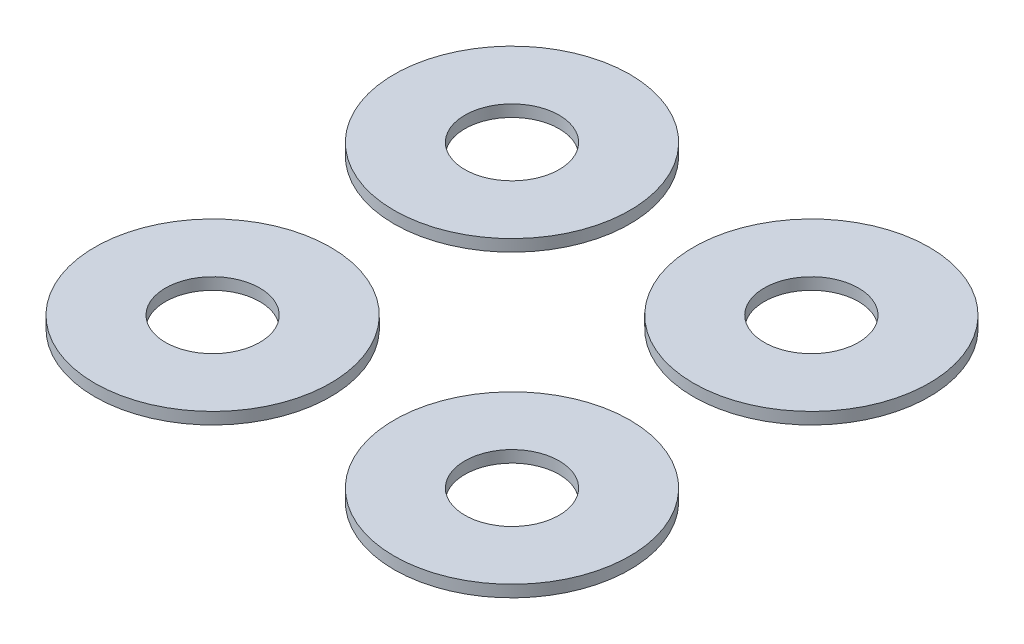
ISO-10303-21;
HEADER;
FILE_DESCRIPTION(('STEP AP214'),'2;1');
FILE_NAME('part.step','',(''),(''),'','','');
FILE_SCHEMA(('AUTOMOTIVE_DESIGN { 1 0 10303 214 1 1 1 1 }'));
ENDSEC;
DATA;
#1=APPLICATION_CONTEXT('core data for automotive mechanical design processes');
#2=APPLICATION_PROTOCOL_DEFINITION('international standard','automotive_design',2000,#1);
#3=PRODUCT_CONTEXT('',#1,'mechanical');
#4=PRODUCT('Part','Part','',(#3));
#5=PRODUCT_RELATED_PRODUCT_CATEGORY('part','',(#4));
#6=PRODUCT_DEFINITION_FORMATION('','',#4);
#7=PRODUCT_DEFINITION_CONTEXT('part definition',#1,'design');
#8=PRODUCT_DEFINITION('design','',#6,#7);
#9=PRODUCT_DEFINITION_SHAPE('','',#8);
#10=(LENGTH_UNIT() NAMED_UNIT(*) SI_UNIT(.MILLI.,.METRE.));
#11=(NAMED_UNIT(*) PLANE_ANGLE_UNIT() SI_UNIT($,.RADIAN.));
#12=(NAMED_UNIT(*) SI_UNIT($,.STERADIAN.) SOLID_ANGLE_UNIT());
#13=UNCERTAINTY_MEASURE_WITH_UNIT(LENGTH_MEASURE(1.E-05),#10,'distance_accuracy_value','');
#14=(GEOMETRIC_REPRESENTATION_CONTEXT(3) GLOBAL_UNCERTAINTY_ASSIGNED_CONTEXT((#13)) GLOBAL_UNIT_ASSIGNED_CONTEXT((#10,
#11,#12)) REPRESENTATION_CONTEXT('',''));
#15=CARTESIAN_POINT('',(0.,0.,0.));
#16=DIRECTION('',(0.,0.,1.));
#17=DIRECTION('',(1.,0.,0.));
#18=AXIS2_PLACEMENT_3D('',#15,#16,#17);
#19=CARTESIAN_POINT('',(1.528,0.1,-3.552));
#20=DIRECTION('',(0.,1.,0.));
#21=DIRECTION('',(0.,0.,1.));
#22=AXIS2_PLACEMENT_3D('',#19,#20,#21);
#23=PLANE('',#22);
#24=CARTESIAN_POINT('',(2.54,0.1,-2.54));
#25=DIRECTION('',(0.,-1.,0.));
#26=DIRECTION('',(0.,0.,-1.));
#27=AXIS2_PLACEMENT_3D('',#24,#25,#26);
#28=CIRCLE('',#27,1.);
#29=CARTESIAN_POINT('',(2.54,0.1,-3.54));
#30=VERTEX_POINT('',#29);
#31=EDGE_CURVE('P0_E30',#30,#30,#28,.T.);
#32=ORIENTED_EDGE('',*,*,#31,.F.);
#33=EDGE_LOOP('',(#32));
#34=FACE_BOUND('',#33,.T.);
#35=CARTESIAN_POINT('',(2.54,0.1,-2.54));
#36=DIRECTION('',(0.,-1.,0.));
#37=DIRECTION('',(0.,0.,-1.));
#38=AXIS2_PLACEMENT_3D('',#35,#36,#37);
#39=CIRCLE('',#38,0.4);
#40=CARTESIAN_POINT('',(2.54,0.1,-2.94));
#41=VERTEX_POINT('',#40);
#42=EDGE_CURVE('P0_E18',#41,#41,#39,.T.);
#43=ORIENTED_EDGE('',*,*,#42,.T.);
#44=EDGE_LOOP('',(#43));
#45=FACE_BOUND('',#44,.T.);
#46=ADVANCED_FACE('P0_F15',(#34,#45),#23,.T.);
#47=CARTESIAN_POINT('',(2.54,0.1,-2.54));
#48=DIRECTION('',(0.,-1.,0.));
#49=DIRECTION('',(0.,0.,-1.));
#50=AXIS2_PLACEMENT_3D('',#47,#48,#49);
#51=CYLINDRICAL_SURFACE('',#50,0.4);
#52=ORIENTED_EDGE('',*,*,#42,.F.);
#53=EDGE_LOOP('',(#52));
#54=FACE_BOUND('',#53,.T.);
#55=CARTESIAN_POINT('',(2.54,0.,-2.54));
#56=DIRECTION('',(0.,-1.,0.));
#57=DIRECTION('',(0.,0.,-1.));
#58=AXIS2_PLACEMENT_3D('',#55,#56,#57);
#59=CIRCLE('',#58,0.4);
#60=CARTESIAN_POINT('',(2.54,0.,-2.94));
#61=VERTEX_POINT('',#60);
#62=EDGE_CURVE('P0_E23',#61,#61,#59,.T.);
#63=ORIENTED_EDGE('',*,*,#62,.T.);
#64=EDGE_LOOP('',(#63));
#65=FACE_BOUND('',#64,.T.);
#66=ADVANCED_FACE('P0_F41',(#54,#65),#51,.F.);
#67=CARTESIAN_POINT('',(2.54,0.1,-2.54));
#68=DIRECTION('',(0.,-1.,0.));
#69=DIRECTION('',(0.,0.,-1.));
#70=AXIS2_PLACEMENT_3D('',#67,#68,#69);
#71=CYLINDRICAL_SURFACE('',#70,1.);
#72=ORIENTED_EDGE('',*,*,#31,.T.);
#73=EDGE_LOOP('',(#72));
#74=FACE_BOUND('',#73,.T.);
#75=CARTESIAN_POINT('',(2.54,0.,-2.54));
#76=DIRECTION('',(0.,-1.,0.));
#77=DIRECTION('',(0.,0.,-1.));
#78=AXIS2_PLACEMENT_3D('',#75,#76,#77);
#79=CIRCLE('',#78,1.);
#80=CARTESIAN_POINT('',(2.54,0.,-3.54));
#81=VERTEX_POINT('',#80);
#82=EDGE_CURVE('P0_E10',#81,#81,#79,.F.);
#83=ORIENTED_EDGE('',*,*,#82,.T.);
#84=EDGE_LOOP('',(#83));
#85=FACE_BOUND('',#84,.T.);
#86=ADVANCED_FACE('P0_F44',(#74,#85),#71,.T.);
#87=CARTESIAN_POINT('',(1.528,0.,-3.552));
#88=DIRECTION('',(0.,1.,0.));
#89=DIRECTION('',(0.,0.,1.));
#90=AXIS2_PLACEMENT_3D('',#87,#88,#89);
#91=PLANE('',#90);
#92=ORIENTED_EDGE('',*,*,#82,.F.);
#93=EDGE_LOOP('',(#92));
#94=FACE_BOUND('',#93,.T.);
#95=ORIENTED_EDGE('',*,*,#62,.F.);
#96=EDGE_LOOP('',(#95));
#97=FACE_BOUND('',#96,.T.);
#98=ADVANCED_FACE('P0_F47',(#94,#97),#91,.F.);
#99=CLOSED_SHELL('',(#46,#66,#86,#98));
#100=MANIFOLD_SOLID_BREP('P0_B1',#99);
#101=CARTESIAN_POINT('',(-1.012,0.,-3.552));
#102=DIRECTION('',(0.,1.,0.));
#103=DIRECTION('',(0.,0.,1.));
#104=AXIS2_PLACEMENT_3D('',#101,#102,#103);
#105=PLANE('',#104);
#106=CARTESIAN_POINT('',(0.,0.,-2.54));
#107=DIRECTION('',(0.,-1.,0.));
#108=DIRECTION('',(0.,0.,-1.));
#109=AXIS2_PLACEMENT_3D('',#106,#107,#108);
#110=CIRCLE('',#109,1.);
#111=CARTESIAN_POINT('',(0.,0.,-3.54));
#112=VERTEX_POINT('',#111);
#113=EDGE_CURVE('P1_E30',#112,#112,#110,.F.);
#114=ORIENTED_EDGE('',*,*,#113,.F.);
#115=EDGE_LOOP('',(#114));
#116=FACE_BOUND('',#115,.T.);
#117=CARTESIAN_POINT('',(0.,0.,-2.54));
#118=DIRECTION('',(0.,-1.,0.));
#119=DIRECTION('',(0.,0.,-1.));
#120=AXIS2_PLACEMENT_3D('',#117,#118,#119);
#121=CIRCLE('',#120,0.4);
#122=CARTESIAN_POINT('',(0.,0.,-2.94));
#123=VERTEX_POINT('',#122);
#124=EDGE_CURVE('P1_E18',#123,#123,#121,.F.);
#125=ORIENTED_EDGE('',*,*,#124,.T.);
#126=EDGE_LOOP('',(#125));
#127=FACE_BOUND('',#126,.T.);
#128=ADVANCED_FACE('P1_F15',(#116,#127),#105,.F.);
#129=CARTESIAN_POINT('',(0.,0.1,-2.54));
#130=DIRECTION('',(0.,-1.,0.));
#131=DIRECTION('',(0.,0.,-1.));
#132=AXIS2_PLACEMENT_3D('',#129,#130,#131);
#133=CYLINDRICAL_SURFACE('',#132,0.4);
#134=CARTESIAN_POINT('',(0.,0.1,-2.54));
#135=DIRECTION('',(0.,-1.,0.));
#136=DIRECTION('',(0.,0.,-1.));
#137=AXIS2_PLACEMENT_3D('',#134,#135,#136);
#138=CIRCLE('',#137,0.4);
#139=CARTESIAN_POINT('',(0.,0.1,-2.94));
#140=VERTEX_POINT('',#139);
#141=EDGE_CURVE('P1_E23',#140,#140,#138,.T.);
#142=ORIENTED_EDGE('',*,*,#141,.F.);
#143=EDGE_LOOP('',(#142));
#144=FACE_BOUND('',#143,.T.);
#145=ORIENTED_EDGE('',*,*,#124,.F.);
#146=EDGE_LOOP('',(#145));
#147=FACE_BOUND('',#146,.T.);
#148=ADVANCED_FACE('P1_F41',(#144,#147),#133,.F.);
#149=CARTESIAN_POINT('',(0.,0.1,-2.54));
#150=DIRECTION('',(0.,-1.,0.));
#151=DIRECTION('',(0.,0.,-1.));
#152=AXIS2_PLACEMENT_3D('',#149,#150,#151);
#153=CYLINDRICAL_SURFACE('',#152,1.);
#154=ORIENTED_EDGE('',*,*,#113,.T.);
#155=EDGE_LOOP('',(#154));
#156=FACE_BOUND('',#155,.T.);
#157=CARTESIAN_POINT('',(0.,0.1,-2.54));
#158=DIRECTION('',(0.,-1.,0.));
#159=DIRECTION('',(0.,0.,-1.));
#160=AXIS2_PLACEMENT_3D('',#157,#158,#159);
#161=CIRCLE('',#160,1.);
#162=CARTESIAN_POINT('',(0.,0.1,-3.54));
#163=VERTEX_POINT('',#162);
#164=EDGE_CURVE('P1_E10',#163,#163,#161,.F.);
#165=ORIENTED_EDGE('',*,*,#164,.F.);
#166=EDGE_LOOP('',(#165));
#167=FACE_BOUND('',#166,.T.);
#168=ADVANCED_FACE('P1_F43',(#156,#167),#153,.T.);
#169=CARTESIAN_POINT('',(-1.012,0.1,-3.552));
#170=DIRECTION('',(0.,1.,0.));
#171=DIRECTION('',(0.,0.,1.));
#172=AXIS2_PLACEMENT_3D('',#169,#170,#171);
#173=PLANE('',#172);
#174=ORIENTED_EDGE('',*,*,#164,.T.);
#175=EDGE_LOOP('',(#174));
#176=FACE_BOUND('',#175,.T.);
#177=ORIENTED_EDGE('',*,*,#141,.T.);
#178=EDGE_LOOP('',(#177));
#179=FACE_BOUND('',#178,.T.);
#180=ADVANCED_FACE('P1_F50',(#176,#179),#173,.T.);
#181=CLOSED_SHELL('',(#128,#148,#168,#180));
#182=MANIFOLD_SOLID_BREP('P1_B1',#181);
#183=CARTESIAN_POINT('',(-1.012,0.1,-1.012));
#184=DIRECTION('',(0.,1.,0.));
#185=DIRECTION('',(0.,0.,1.));
#186=AXIS2_PLACEMENT_3D('',#183,#184,#185);
#187=PLANE('',#186);
#188=CARTESIAN_POINT('',(0.,0.1,0.));
#189=DIRECTION('',(0.,-1.,0.));
#190=DIRECTION('',(0.,0.,-1.));
#191=AXIS2_PLACEMENT_3D('',#188,#189,#190);
#192=CIRCLE('',#191,1.);
#193=CARTESIAN_POINT('',(0.,0.1,-1.));
#194=VERTEX_POINT('',#193);
#195=EDGE_CURVE('P2_E31',#194,#194,#192,.T.);
#196=ORIENTED_EDGE('',*,*,#195,.F.);
#197=EDGE_LOOP('',(#196));
#198=FACE_BOUND('',#197,.T.);
#199=CARTESIAN_POINT('',(0.,0.1,0.));
#200=DIRECTION('',(0.,-1.,0.));
#201=DIRECTION('',(0.,0.,-1.));
#202=AXIS2_PLACEMENT_3D('',#199,#200,#201);
#203=CIRCLE('',#202,0.4);
#204=CARTESIAN_POINT('',(0.,0.1,-0.4));
#205=VERTEX_POINT('',#204);
#206=EDGE_CURVE('P2_E18',#205,#205,#203,.T.);
#207=ORIENTED_EDGE('',*,*,#206,.T.);
#208=EDGE_LOOP('',(#207));
#209=FACE_BOUND('',#208,.T.);
#210=ADVANCED_FACE('P2_F15',(#198,#209),#187,.T.);
#211=CARTESIAN_POINT('',(0.,0.1,0.));
#212=DIRECTION('',(0.,-1.,0.));
#213=DIRECTION('',(0.,0.,-1.));
#214=AXIS2_PLACEMENT_3D('',#211,#212,#213);
#215=CYLINDRICAL_SURFACE('',#214,0.4);
#216=ORIENTED_EDGE('',*,*,#206,.F.);
#217=EDGE_LOOP('',(#216));
#218=FACE_BOUND('',#217,.T.);
#219=CARTESIAN_POINT('',(0.,0.,0.));
#220=DIRECTION('',(0.,-1.,0.));
#221=DIRECTION('',(0.,0.,-1.));
#222=AXIS2_PLACEMENT_3D('',#219,#220,#221);
#223=CIRCLE('',#222,0.4);
#224=CARTESIAN_POINT('',(0.,0.,-0.4));
#225=VERTEX_POINT('',#224);
#226=EDGE_CURVE('P2_E23',#225,#225,#223,.T.);
#227=ORIENTED_EDGE('',*,*,#226,.T.);
#228=EDGE_LOOP('',(#227));
#229=FACE_BOUND('',#228,.T.);
#230=ADVANCED_FACE('P2_F41',(#218,#229),#215,.F.);
#231=CARTESIAN_POINT('',(0.,0.1,0.));
#232=DIRECTION('',(0.,-1.,0.));
#233=DIRECTION('',(0.,0.,-1.));
#234=AXIS2_PLACEMENT_3D('',#231,#232,#233);
#235=CYLINDRICAL_SURFACE('',#234,1.);
#236=ORIENTED_EDGE('',*,*,#195,.T.);
#237=EDGE_LOOP('',(#236));
#238=FACE_BOUND('',#237,.T.);
#239=CARTESIAN_POINT('',(0.,0.,0.));
#240=DIRECTION('',(0.,-1.,0.));
#241=DIRECTION('',(0.,0.,-1.));
#242=AXIS2_PLACEMENT_3D('',#239,#240,#241);
#243=CIRCLE('',#242,1.);
#244=CARTESIAN_POINT('',(0.,0.,-1.));
#245=VERTEX_POINT('',#244);
#246=EDGE_CURVE('P2_E10',#245,#245,#243,.F.);
#247=ORIENTED_EDGE('',*,*,#246,.T.);
#248=EDGE_LOOP('',(#247));
#249=FACE_BOUND('',#248,.T.);
#250=ADVANCED_FACE('P2_F44',(#238,#249),#235,.T.);
#251=CARTESIAN_POINT('',(-1.012,0.,-1.012));
#252=DIRECTION('',(0.,1.,0.));
#253=DIRECTION('',(0.,0.,1.));
#254=AXIS2_PLACEMENT_3D('',#251,#252,#253);
#255=PLANE('',#254);
#256=ORIENTED_EDGE('',*,*,#246,.F.);
#257=EDGE_LOOP('',(#256));
#258=FACE_BOUND('',#257,.T.);
#259=ORIENTED_EDGE('',*,*,#226,.F.);
#260=EDGE_LOOP('',(#259));
#261=FACE_BOUND('',#260,.T.);
#262=ADVANCED_FACE('P2_F47',(#258,#261),#255,.F.);
#263=CLOSED_SHELL('',(#210,#230,#250,#262));
#264=MANIFOLD_SOLID_BREP('P2_B1',#263);
#265=CARTESIAN_POINT('',(1.528,0.,-1.012));
#266=DIRECTION('',(0.,1.,0.));
#267=DIRECTION('',(0.,0.,1.));
#268=AXIS2_PLACEMENT_3D('',#265,#266,#267);
#269=PLANE('',#268);
#270=CARTESIAN_POINT('',(2.54,0.,0.));
#271=DIRECTION('',(0.,-1.,0.));
#272=DIRECTION('',(0.,0.,-1.));
#273=AXIS2_PLACEMENT_3D('',#270,#271,#272);
#274=CIRCLE('',#273,1.);
#275=CARTESIAN_POINT('',(2.54,0.,-1.));
#276=VERTEX_POINT('',#275);
#277=EDGE_CURVE('P3_E31',#276,#276,#274,.F.);
#278=ORIENTED_EDGE('',*,*,#277,.F.);
#279=EDGE_LOOP('',(#278));
#280=FACE_BOUND('',#279,.T.);
#281=CARTESIAN_POINT('',(2.54,0.,0.));
#282=DIRECTION('',(0.,-1.,0.));
#283=DIRECTION('',(0.,0.,-1.));
#284=AXIS2_PLACEMENT_3D('',#281,#282,#283);
#285=CIRCLE('',#284,0.4);
#286=CARTESIAN_POINT('',(2.54,0.,-0.4));
#287=VERTEX_POINT('',#286);
#288=EDGE_CURVE('P3_E18',#287,#287,#285,.F.);
#289=ORIENTED_EDGE('',*,*,#288,.T.);
#290=EDGE_LOOP('',(#289));
#291=FACE_BOUND('',#290,.T.);
#292=ADVANCED_FACE('P3_F15',(#280,#291),#269,.F.);
#293=CARTESIAN_POINT('',(2.54,0.1,0.));
#294=DIRECTION('',(0.,-1.,0.));
#295=DIRECTION('',(0.,0.,-1.));
#296=AXIS2_PLACEMENT_3D('',#293,#294,#295);
#297=CYLINDRICAL_SURFACE('',#296,0.4);
#298=CARTESIAN_POINT('',(2.54,0.1,0.));
#299=DIRECTION('',(0.,-1.,0.));
#300=DIRECTION('',(0.,0.,-1.));
#301=AXIS2_PLACEMENT_3D('',#298,#299,#300);
#302=CIRCLE('',#301,0.4);
#303=CARTESIAN_POINT('',(2.54,0.1,-0.4));
#304=VERTEX_POINT('',#303);
#305=EDGE_CURVE('P3_E23',#304,#304,#302,.T.);
#306=ORIENTED_EDGE('',*,*,#305,.F.);
#307=EDGE_LOOP('',(#306));
#308=FACE_BOUND('',#307,.T.);
#309=ORIENTED_EDGE('',*,*,#288,.F.);
#310=EDGE_LOOP('',(#309));
#311=FACE_BOUND('',#310,.T.);
#312=ADVANCED_FACE('P3_F41',(#308,#311),#297,.F.);
#313=CARTESIAN_POINT('',(2.54,0.1,0.));
#314=DIRECTION('',(0.,-1.,0.));
#315=DIRECTION('',(0.,0.,-1.));
#316=AXIS2_PLACEMENT_3D('',#313,#314,#315);
#317=CYLINDRICAL_SURFACE('',#316,1.);
#318=ORIENTED_EDGE('',*,*,#277,.T.);
#319=EDGE_LOOP('',(#318));
#320=FACE_BOUND('',#319,.T.);
#321=CARTESIAN_POINT('',(2.54,0.1,0.));
#322=DIRECTION('',(0.,-1.,0.));
#323=DIRECTION('',(0.,0.,-1.));
#324=AXIS2_PLACEMENT_3D('',#321,#322,#323);
#325=CIRCLE('',#324,1.);
#326=CARTESIAN_POINT('',(2.54,0.1,-1.));
#327=VERTEX_POINT('',#326);
#328=EDGE_CURVE('P3_E10',#327,#327,#325,.F.);
#329=ORIENTED_EDGE('',*,*,#328,.F.);
#330=EDGE_LOOP('',(#329));
#331=FACE_BOUND('',#330,.T.);
#332=ADVANCED_FACE('P3_F43',(#320,#331),#317,.T.);
#333=CARTESIAN_POINT('',(1.528,0.1,-1.012));
#334=DIRECTION('',(0.,1.,0.));
#335=DIRECTION('',(0.,0.,1.));
#336=AXIS2_PLACEMENT_3D('',#333,#334,#335);
#337=PLANE('',#336);
#338=ORIENTED_EDGE('',*,*,#328,.T.);
#339=EDGE_LOOP('',(#338));
#340=FACE_BOUND('',#339,.T.);
#341=ORIENTED_EDGE('',*,*,#305,.T.);
#342=EDGE_LOOP('',(#341));
#343=FACE_BOUND('',#342,.T.);
#344=ADVANCED_FACE('P3_F50',(#340,#343),#337,.T.);
#345=CLOSED_SHELL('',(#292,#312,#332,#344));
#346=MANIFOLD_SOLID_BREP('P3_B1',#345);
#347=ADVANCED_BREP_SHAPE_REPRESENTATION('',(#18,#100,#182,#264,#346),#14);
#348=SHAPE_DEFINITION_REPRESENTATION(#9,#347);
ENDSEC;
END-ISO-10303-21;
